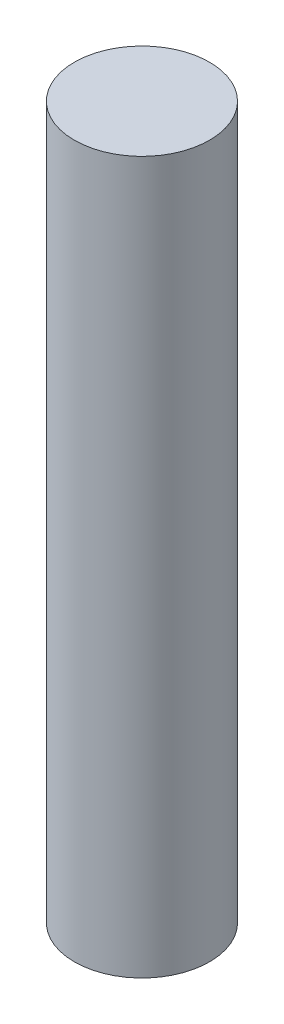
ISO-10303-21;
HEADER;
FILE_DESCRIPTION(('STEP AP214'),'2;1');
FILE_NAME('part.step','',(''),(''),'','','');
FILE_SCHEMA(('AUTOMOTIVE_DESIGN { 1 0 10303 214 1 1 1 1 }'));
ENDSEC;
DATA;
#1=APPLICATION_CONTEXT('core data for automotive mechanical design processes');
#2=APPLICATION_PROTOCOL_DEFINITION('international standard','automotive_design',2000,#1);
#3=PRODUCT_CONTEXT('',#1,'mechanical');
#4=PRODUCT('Part','Part','',(#3));
#5=PRODUCT_RELATED_PRODUCT_CATEGORY('part','',(#4));
#6=PRODUCT_DEFINITION_FORMATION('','',#4);
#7=PRODUCT_DEFINITION_CONTEXT('part definition',#1,'design');
#8=PRODUCT_DEFINITION('design','',#6,#7);
#9=PRODUCT_DEFINITION_SHAPE('','',#8);
#10=(LENGTH_UNIT() NAMED_UNIT(*) SI_UNIT(.MILLI.,.METRE.));
#11=(NAMED_UNIT(*) PLANE_ANGLE_UNIT() SI_UNIT($,.RADIAN.));
#12=(NAMED_UNIT(*) SI_UNIT($,.STERADIAN.) SOLID_ANGLE_UNIT());
#13=UNCERTAINTY_MEASURE_WITH_UNIT(LENGTH_MEASURE(1.E-05),#10,'distance_accuracy_value','');
#14=(GEOMETRIC_REPRESENTATION_CONTEXT(3) GLOBAL_UNCERTAINTY_ASSIGNED_CONTEXT((#13)) GLOBAL_UNIT_ASSIGNED_CONTEXT((#10,
#11,#12)) REPRESENTATION_CONTEXT('',''));
#15=CARTESIAN_POINT('',(0.,0.,0.));
#16=DIRECTION('',(0.,0.,1.));
#17=DIRECTION('',(1.,0.,0.));
#18=AXIS2_PLACEMENT_3D('',#15,#16,#17);
#19=CARTESIAN_POINT('',(1.94981043420037,50.8,0.248918830400485));
#20=DIRECTION('',(0.,-1.,0.));
#21=DIRECTION('',(0.,0.,-1.));
#22=AXIS2_PLACEMENT_3D('',#19,#20,#21);
#23=CYLINDRICAL_SURFACE('',#22,4.82599999999999);
#24=CARTESIAN_POINT('',(1.94981043420037,50.8,0.248918830400485));
#25=DIRECTION('',(0.,1.,0.));
#26=DIRECTION('',(0.,0.,1.));
#27=AXIS2_PLACEMENT_3D('',#24,#25,#26);
#28=CIRCLE('',#27,4.82599999999999);
#29=CARTESIAN_POINT('',(1.94981043420037,50.8,5.07491883040047));
#30=VERTEX_POINT('',#29);
#31=EDGE_CURVE('E10',#30,#30,#28,.T.);
#32=ORIENTED_EDGE('',*,*,#31,.F.);
#33=EDGE_LOOP('',(#32));
#34=FACE_BOUND('',#33,.T.);
#35=CARTESIAN_POINT('',(1.94981043420037,0.,0.248918830400485));
#36=DIRECTION('',(0.,1.,0.));
#37=DIRECTION('',(0.,0.,1.));
#38=AXIS2_PLACEMENT_3D('',#35,#36,#37);
#39=CIRCLE('',#38,4.82599999999999);
#40=CARTESIAN_POINT('',(1.94981043420037,0.,5.07491883040047));
#41=VERTEX_POINT('',#40);
#42=EDGE_CURVE('E36',#41,#41,#39,.T.);
#43=ORIENTED_EDGE('',*,*,#42,.T.);
#44=EDGE_LOOP('',(#43));
#45=FACE_BOUND('',#44,.T.);
#46=ADVANCED_FACE('F33',(#34,#45),#23,.T.);
#47=CARTESIAN_POINT('',(1.94981043420037,50.8,0.248918830400485));
#48=DIRECTION('',(0.,1.,0.));
#49=DIRECTION('',(0.,0.,1.));
#50=AXIS2_PLACEMENT_3D('',#47,#48,#49);
#51=PLANE('',#50);
#52=ORIENTED_EDGE('',*,*,#31,.T.);
#53=EDGE_LOOP('',(#52));
#54=FACE_BOUND('',#53,.T.);
#55=ADVANCED_FACE('F48',(#54),#51,.T.);
#56=CARTESIAN_POINT('',(1.94981043420037,0.,0.248918830400485));
#57=DIRECTION('',(0.,1.,0.));
#58=DIRECTION('',(0.,0.,1.));
#59=AXIS2_PLACEMENT_3D('',#56,#57,#58);
#60=PLANE('',#59);
#61=ORIENTED_EDGE('',*,*,#42,.F.);
#62=EDGE_LOOP('',(#61));
#63=FACE_BOUND('',#62,.T.);
#64=ADVANCED_FACE('F46',(#63),#60,.F.);
#65=CLOSED_SHELL('',(#46,#55,#64));
#66=MANIFOLD_SOLID_BREP('B2',#65);
#67=ADVANCED_BREP_SHAPE_REPRESENTATION('',(#18,#66),#14);
#68=SHAPE_DEFINITION_REPRESENTATION(#9,#67);
ENDSEC;
END-ISO-10303-21;
